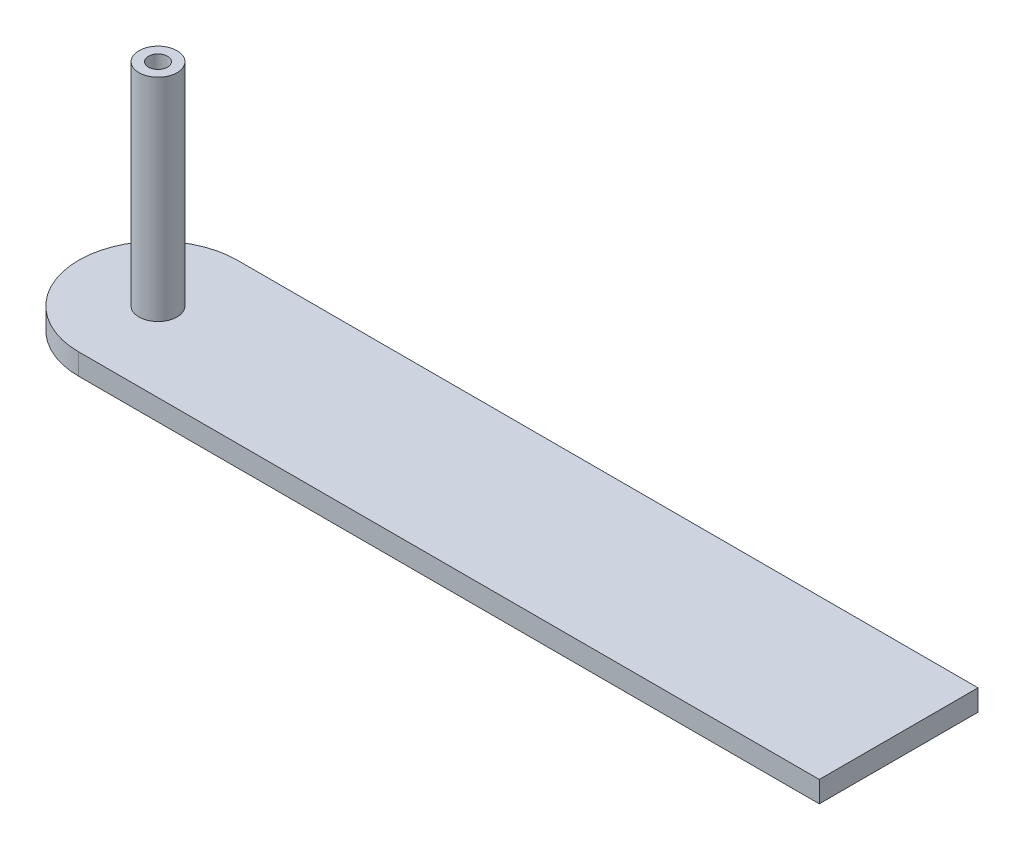
ISO-10303-21;
HEADER;
FILE_DESCRIPTION(('STEP AP214'),'2;1');
FILE_NAME('part.step','',(''),(''),'','','');
FILE_SCHEMA(('AUTOMOTIVE_DESIGN { 1 0 10303 214 1 1 1 1 }'));
ENDSEC;
DATA;
#1=APPLICATION_CONTEXT('core data for automotive mechanical design processes');
#2=APPLICATION_PROTOCOL_DEFINITION('international standard','automotive_design',2000,#1);
#3=PRODUCT_CONTEXT('',#1,'mechanical');
#4=PRODUCT('Part','Part','',(#3));
#5=PRODUCT_RELATED_PRODUCT_CATEGORY('part','',(#4));
#6=PRODUCT_DEFINITION_FORMATION('','',#4);
#7=PRODUCT_DEFINITION_CONTEXT('part definition',#1,'design');
#8=PRODUCT_DEFINITION('design','',#6,#7);
#9=PRODUCT_DEFINITION_SHAPE('','',#8);
#10=(LENGTH_UNIT() NAMED_UNIT(*) SI_UNIT(.MILLI.,.METRE.));
#11=(NAMED_UNIT(*) PLANE_ANGLE_UNIT() SI_UNIT($,.RADIAN.));
#12=(NAMED_UNIT(*) SI_UNIT($,.STERADIAN.) SOLID_ANGLE_UNIT());
#13=UNCERTAINTY_MEASURE_WITH_UNIT(LENGTH_MEASURE(1.E-05),#10,'distance_accuracy_value','');
#14=(GEOMETRIC_REPRESENTATION_CONTEXT(3) GLOBAL_UNCERTAINTY_ASSIGNED_CONTEXT((#13)) GLOBAL_UNIT_ASSIGNED_CONTEXT((#10,
#11,#12)) REPRESENTATION_CONTEXT('',''));
#15=CARTESIAN_POINT('',(0.,0.,0.));
#16=DIRECTION('',(0.,0.,1.));
#17=DIRECTION('',(1.,0.,0.));
#18=AXIS2_PLACEMENT_3D('',#15,#16,#17);
#19=CARTESIAN_POINT('',(0.,2.,0.));
#20=DIRECTION('',(0.,0.,-1.));
#21=DIRECTION('',(-1.,0.,0.));
#22=AXIS2_PLACEMENT_3D('',#19,#20,#21);
#23=PLANE('',#22);
#24=DIRECTION('',(1.,0.,0.));
#25=VECTOR('',#24,1.);
#26=CARTESIAN_POINT('',(0.,0.,0.));
#27=LINE('',#26,#25);
#28=CARTESIAN_POINT('',(0.,0.,0.));
#29=VERTEX_POINT('',#28);
#30=CARTESIAN_POINT('',(70.,0.,0.));
#31=VERTEX_POINT('',#30);
#32=EDGE_CURVE('E78',#29,#31,#27,.T.);
#33=ORIENTED_EDGE('',*,*,#32,.T.);
#34=DIRECTION('',(0.,-1.,0.));
#35=VECTOR('',#34,1.);
#36=CARTESIAN_POINT('',(70.,2.,0.));
#37=LINE('',#36,#35);
#38=CARTESIAN_POINT('',(70.,2.,0.));
#39=VERTEX_POINT('',#38);
#40=EDGE_CURVE('E11',#39,#31,#37,.T.);
#41=ORIENTED_EDGE('',*,*,#40,.F.);
#42=DIRECTION('',(1.,0.,0.));
#43=VECTOR('',#42,1.);
#44=CARTESIAN_POINT('',(0.,2.,0.));
#45=LINE('',#44,#43);
#46=CARTESIAN_POINT('',(0.,2.,0.));
#47=VERTEX_POINT('',#46);
#48=EDGE_CURVE('E94',#47,#39,#45,.T.);
#49=ORIENTED_EDGE('',*,*,#48,.F.);
#50=DIRECTION('',(0.,-1.,0.));
#51=VECTOR('',#50,1.);
#52=CARTESIAN_POINT('',(0.,2.,0.));
#53=LINE('',#52,#51);
#54=EDGE_CURVE('E91',#47,#29,#53,.T.);
#55=ORIENTED_EDGE('',*,*,#54,.T.);
#56=EDGE_LOOP('',(#33,#41,#49,#55));
#57=FACE_BOUND('',#56,.T.);
#58=ADVANCED_FACE('F38',(#57),#23,.F.);
#59=CARTESIAN_POINT('',(70.,2.,0.));
#60=DIRECTION('',(-1.,0.,0.));
#61=DIRECTION('',(0.,0.,1.));
#62=AXIS2_PLACEMENT_3D('',#59,#60,#61);
#63=PLANE('',#62);
#64=DIRECTION('',(0.,0.,-1.));
#65=VECTOR('',#64,1.);
#66=CARTESIAN_POINT('',(70.,0.,0.));
#67=LINE('',#66,#65);
#68=CARTESIAN_POINT('',(70.,0.,-15.));
#69=VERTEX_POINT('',#68);
#70=EDGE_CURVE('E95',#31,#69,#67,.T.);
#71=ORIENTED_EDGE('',*,*,#70,.T.);
#72=DIRECTION('',(0.,-1.,0.));
#73=VECTOR('',#72,1.);
#74=CARTESIAN_POINT('',(70.,2.,-15.));
#75=LINE('',#74,#73);
#76=CARTESIAN_POINT('',(70.,2.,-15.));
#77=VERTEX_POINT('',#76);
#78=EDGE_CURVE('E46',#77,#69,#75,.T.);
#79=ORIENTED_EDGE('',*,*,#78,.F.);
#80=DIRECTION('',(0.,0.,-1.));
#81=VECTOR('',#80,1.);
#82=CARTESIAN_POINT('',(70.,2.,0.));
#83=LINE('',#82,#81);
#84=EDGE_CURVE('E54',#39,#77,#83,.T.);
#85=ORIENTED_EDGE('',*,*,#84,.F.);
#86=ORIENTED_EDGE('',*,*,#40,.T.);
#87=EDGE_LOOP('',(#71,#79,#85,#86));
#88=FACE_BOUND('',#87,.T.);
#89=ADVANCED_FACE('F152',(#88),#63,.F.);
#90=CARTESIAN_POINT('',(0.,2.,-15.));
#91=DIRECTION('',(0.,0.,-1.));
#92=DIRECTION('',(-1.,0.,0.));
#93=AXIS2_PLACEMENT_3D('',#90,#91,#92);
#94=PLANE('',#93);
#95=DIRECTION('',(1.,0.,0.));
#96=VECTOR('',#95,1.);
#97=CARTESIAN_POINT('',(0.,0.,-15.));
#98=LINE('',#97,#96);
#99=CARTESIAN_POINT('',(0.,0.,-15.));
#100=VERTEX_POINT('',#99);
#101=EDGE_CURVE('E76',#100,#69,#98,.T.);
#102=ORIENTED_EDGE('',*,*,#101,.F.);
#103=DIRECTION('',(0.,-1.,0.));
#104=VECTOR('',#103,1.);
#105=CARTESIAN_POINT('',(0.,2.,-15.));
#106=LINE('',#105,#104);
#107=CARTESIAN_POINT('',(0.,2.,-15.));
#108=VERTEX_POINT('',#107);
#109=EDGE_CURVE('E87',#108,#100,#106,.T.);
#110=ORIENTED_EDGE('',*,*,#109,.F.);
#111=DIRECTION('',(1.,0.,0.));
#112=VECTOR('',#111,1.);
#113=CARTESIAN_POINT('',(0.,2.,-15.));
#114=LINE('',#113,#112);
#115=EDGE_CURVE('E101',#108,#77,#114,.T.);
#116=ORIENTED_EDGE('',*,*,#115,.T.);
#117=ORIENTED_EDGE('',*,*,#78,.T.);
#118=EDGE_LOOP('',(#102,#110,#116,#117));
#119=FACE_BOUND('',#118,.T.);
#120=ADVANCED_FACE('F93',(#119),#94,.T.);
#121=CARTESIAN_POINT('',(0.,2.,0.));
#122=DIRECTION('',(0.,1.,0.));
#123=DIRECTION('',(0.,0.,1.));
#124=AXIS2_PLACEMENT_3D('',#121,#122,#123);
#125=PLANE('',#124);
#126=CARTESIAN_POINT('',(0.,2.,-7.5));
#127=DIRECTION('',(0.,1.,0.));
#128=DIRECTION('',(0.,0.,1.));
#129=AXIS2_PLACEMENT_3D('',#126,#127,#128);
#130=CIRCLE('',#129,1.8);
#131=CARTESIAN_POINT('',(0.,2.,-5.7));
#132=VERTEX_POINT('',#131);
#133=EDGE_CURVE('E110',#132,#132,#130,.T.);
#134=ORIENTED_EDGE('',*,*,#133,.F.);
#135=EDGE_LOOP('',(#134));
#136=FACE_BOUND('',#135,.T.);
#137=ORIENTED_EDGE('',*,*,#115,.F.);
#138=CARTESIAN_POINT('',(0.,2.,-7.5));
#139=DIRECTION('',(0.,1.,0.));
#140=DIRECTION('',(0.,0.,1.));
#141=AXIS2_PLACEMENT_3D('',#138,#139,#140);
#142=CIRCLE('',#141,7.5);
#143=EDGE_CURVE('E82',#108,#47,#142,.T.);
#144=ORIENTED_EDGE('',*,*,#143,.T.);
#145=ORIENTED_EDGE('',*,*,#48,.T.);
#146=ORIENTED_EDGE('',*,*,#84,.T.);
#147=EDGE_LOOP('',(#137,#144,#145,#146));
#148=FACE_BOUND('',#147,.T.);
#149=ADVANCED_FACE('F142',(#136,#148),#125,.T.);
#150=CARTESIAN_POINT('',(0.,0.,0.));
#151=DIRECTION('',(0.,1.,0.));
#152=DIRECTION('',(0.,0.,1.));
#153=AXIS2_PLACEMENT_3D('',#150,#151,#152);
#154=PLANE('',#153);
#155=ORIENTED_EDGE('',*,*,#32,.F.);
#156=CARTESIAN_POINT('',(0.,0.,-7.5));
#157=DIRECTION('',(0.,1.,0.));
#158=DIRECTION('',(0.,0.,1.));
#159=AXIS2_PLACEMENT_3D('',#156,#157,#158);
#160=CIRCLE('',#159,7.5);
#161=EDGE_CURVE('E73',#100,#29,#160,.T.);
#162=ORIENTED_EDGE('',*,*,#161,.F.);
#163=ORIENTED_EDGE('',*,*,#101,.T.);
#164=ORIENTED_EDGE('',*,*,#70,.F.);
#165=EDGE_LOOP('',(#155,#162,#163,#164));
#166=FACE_BOUND('',#165,.T.);
#167=ADVANCED_FACE('F75',(#166),#154,.F.);
#168=CARTESIAN_POINT('',(0.,2.,-7.5));
#169=DIRECTION('',(0.,-1.,0.));
#170=DIRECTION('',(0.,0.,-1.));
#171=AXIS2_PLACEMENT_3D('',#168,#169,#170);
#172=CYLINDRICAL_SURFACE('',#171,7.5);
#173=ORIENTED_EDGE('',*,*,#109,.T.);
#174=ORIENTED_EDGE('',*,*,#161,.T.);
#175=ORIENTED_EDGE('',*,*,#54,.F.);
#176=ORIENTED_EDGE('',*,*,#143,.F.);
#177=EDGE_LOOP('',(#173,#174,#175,#176));
#178=FACE_BOUND('',#177,.T.);
#179=ADVANCED_FACE('F88',(#178),#172,.T.);
#180=CARTESIAN_POINT('',(0.,22.,-7.5));
#181=DIRECTION('',(0.,-1.,0.));
#182=DIRECTION('',(0.,0.,-1.));
#183=AXIS2_PLACEMENT_3D('',#180,#181,#182);
#184=CYLINDRICAL_SURFACE('',#183,1.8);
#185=CARTESIAN_POINT('',(0.,22.,-7.5));
#186=DIRECTION('',(0.,1.,0.));
#187=DIRECTION('',(0.,0.,1.));
#188=AXIS2_PLACEMENT_3D('',#185,#186,#187);
#189=CIRCLE('',#188,1.8);
#190=CARTESIAN_POINT('',(0.,22.,-5.7));
#191=VERTEX_POINT('',#190);
#192=EDGE_CURVE('E83',#191,#191,#189,.T.);
#193=ORIENTED_EDGE('',*,*,#192,.F.);
#194=EDGE_LOOP('',(#193));
#195=FACE_BOUND('',#194,.T.);
#196=ORIENTED_EDGE('',*,*,#133,.T.);
#197=EDGE_LOOP('',(#196));
#198=FACE_BOUND('',#197,.T.);
#199=ADVANCED_FACE('F133',(#195,#198),#184,.T.);
#200=CARTESIAN_POINT('',(0.,22.,-7.5));
#201=DIRECTION('',(0.,1.,0.));
#202=DIRECTION('',(0.,0.,1.));
#203=AXIS2_PLACEMENT_3D('',#200,#201,#202);
#204=PLANE('',#203);
#205=CARTESIAN_POINT('',(0.,22.,-7.5));
#206=DIRECTION('',(0.,1.,0.));
#207=DIRECTION('',(0.,0.,1.));
#208=AXIS2_PLACEMENT_3D('',#205,#206,#207);
#209=CIRCLE('',#208,0.9);
#210=CARTESIAN_POINT('',(0.,22.,-6.6));
#211=VERTEX_POINT('',#210);
#212=EDGE_CURVE('E116',#211,#211,#209,.T.);
#213=ORIENTED_EDGE('',*,*,#212,.F.);
#214=EDGE_LOOP('',(#213));
#215=FACE_BOUND('',#214,.T.);
#216=ORIENTED_EDGE('',*,*,#192,.T.);
#217=EDGE_LOOP('',(#216));
#218=FACE_BOUND('',#217,.T.);
#219=ADVANCED_FACE('F127',(#215,#218),#204,.T.);
#220=CARTESIAN_POINT('',(0.,15.5,-7.5));
#221=DIRECTION('',(0.,1.,0.));
#222=DIRECTION('',(0.,0.,1.));
#223=AXIS2_PLACEMENT_3D('',#220,#221,#222);
#224=CYLINDRICAL_SURFACE('',#223,0.9);
#225=CARTESIAN_POINT('',(0.,15.5,-7.5));
#226=DIRECTION('',(0.,1.,0.));
#227=DIRECTION('',(0.,0.,1.));
#228=AXIS2_PLACEMENT_3D('',#225,#226,#227);
#229=CIRCLE('',#228,0.9);
#230=CARTESIAN_POINT('',(0.,15.5,-6.6));
#231=VERTEX_POINT('',#230);
#232=EDGE_CURVE('E113',#231,#231,#229,.T.);
#233=ORIENTED_EDGE('',*,*,#232,.F.);
#234=EDGE_LOOP('',(#233));
#235=FACE_BOUND('',#234,.T.);
#236=ORIENTED_EDGE('',*,*,#212,.T.);
#237=EDGE_LOOP('',(#236));
#238=FACE_BOUND('',#237,.T.);
#239=ADVANCED_FACE('F124',(#235,#238),#224,.F.);
#240=CARTESIAN_POINT('',(0.,15.5,-7.5));
#241=DIRECTION('',(0.,1.,0.));
#242=DIRECTION('',(0.,0.,1.));
#243=AXIS2_PLACEMENT_3D('',#240,#241,#242);
#244=PLANE('',#243);
#245=ORIENTED_EDGE('',*,*,#232,.T.);
#246=EDGE_LOOP('',(#245));
#247=FACE_BOUND('',#246,.T.);
#248=ADVANCED_FACE('F122',(#247),#244,.T.);
#249=CLOSED_SHELL('',(#58,#89,#120,#149,#167,#179,#199,#219,#239,#248));
#250=MANIFOLD_SOLID_BREP('B2',#249);
#251=ADVANCED_BREP_SHAPE_REPRESENTATION('',(#18,#250),#14);
#252=SHAPE_DEFINITION_REPRESENTATION(#9,#251);
ENDSEC;
END-ISO-10303-21;
